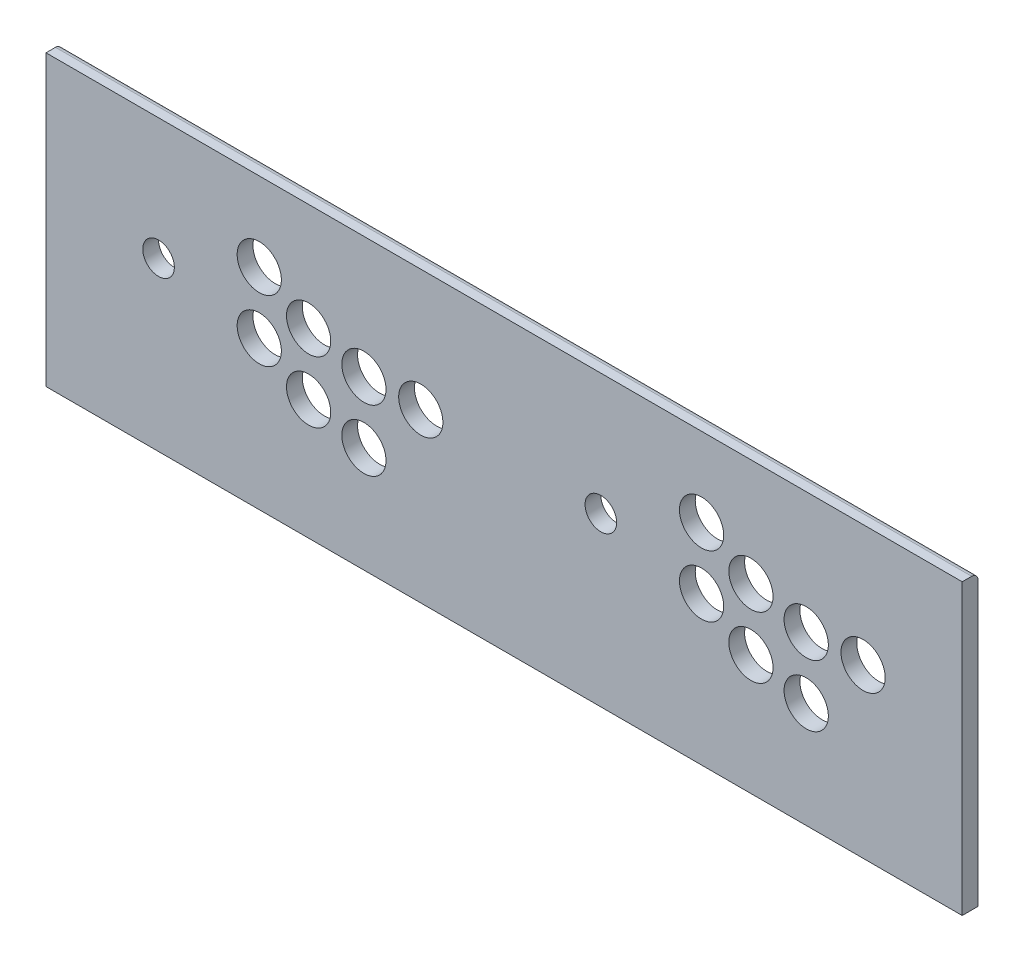
ISO-10303-21;
HEADER;
FILE_DESCRIPTION(('STEP AP214'),'2;1');
FILE_NAME('part.step','',(''),(''),'','','');
FILE_SCHEMA(('AUTOMOTIVE_DESIGN { 1 0 10303 214 1 1 1 1 }'));
ENDSEC;
DATA;
#1=APPLICATION_CONTEXT('core data for automotive mechanical design processes');
#2=APPLICATION_PROTOCOL_DEFINITION('international standard','automotive_design',2000,#1);
#3=PRODUCT_CONTEXT('',#1,'mechanical');
#4=PRODUCT('Part','Part','',(#3));
#5=PRODUCT_RELATED_PRODUCT_CATEGORY('part','',(#4));
#6=PRODUCT_DEFINITION_FORMATION('','',#4);
#7=PRODUCT_DEFINITION_CONTEXT('part definition',#1,'design');
#8=PRODUCT_DEFINITION('design','',#6,#7);
#9=PRODUCT_DEFINITION_SHAPE('','',#8);
#10=(LENGTH_UNIT() NAMED_UNIT(*) SI_UNIT(.MILLI.,.METRE.));
#11=(NAMED_UNIT(*) PLANE_ANGLE_UNIT() SI_UNIT($,.RADIAN.));
#12=(NAMED_UNIT(*) SI_UNIT($,.STERADIAN.) SOLID_ANGLE_UNIT());
#13=UNCERTAINTY_MEASURE_WITH_UNIT(LENGTH_MEASURE(1.E-05),#10,'distance_accuracy_value','');
#14=(GEOMETRIC_REPRESENTATION_CONTEXT(3) GLOBAL_UNCERTAINTY_ASSIGNED_CONTEXT((#13)) GLOBAL_UNIT_ASSIGNED_CONTEXT((#10,
#11,#12)) REPRESENTATION_CONTEXT('',''));
#15=CARTESIAN_POINT('',(0.,0.,0.));
#16=DIRECTION('',(0.,0.,1.));
#17=DIRECTION('',(1.,0.,0.));
#18=AXIS2_PLACEMENT_3D('',#15,#16,#17);
#19=CARTESIAN_POINT('',(0.,0.,10.));
#20=DIRECTION('',(1.,0.,0.));
#21=DIRECTION('',(0.,0.,-1.));
#22=AXIS2_PLACEMENT_3D('',#19,#20,#21);
#23=PLANE('',#22);
#24=DIRECTION('',(0.,0.,-1.));
#25=VECTOR('',#24,1.);
#26=CARTESIAN_POINT('',(0.,183.,10.));
#27=LINE('',#26,#25);
#28=CARTESIAN_POINT('',(0.,183.,10.));
#29=VERTEX_POINT('',#28);
#30=CARTESIAN_POINT('',(0.,183.,4.));
#31=VERTEX_POINT('',#30);
#32=EDGE_CURVE('E110',#29,#31,#27,.T.);
#33=ORIENTED_EDGE('',*,*,#32,.T.);
#34=CARTESIAN_POINT('',(0.,179.,4.));
#35=DIRECTION('',(1.,0.,0.));
#36=DIRECTION('',(0.,0.,-1.));
#37=AXIS2_PLACEMENT_3D('',#34,#35,#36);
#38=CIRCLE('',#37,4.);
#39=CARTESIAN_POINT('',(0.,179.,0.));
#40=VERTEX_POINT('',#39);
#41=EDGE_CURVE('E55',#31,#40,#38,.F.);
#42=ORIENTED_EDGE('',*,*,#41,.T.);
#43=DIRECTION('',(0.,-1.,0.));
#44=VECTOR('',#43,1.);
#45=CARTESIAN_POINT('',(0.,0.,0.));
#46=LINE('',#45,#44);
#47=CARTESIAN_POINT('',(0.,0.,0.));
#48=VERTEX_POINT('',#47);
#49=EDGE_CURVE('E98',#40,#48,#46,.T.);
#50=ORIENTED_EDGE('',*,*,#49,.T.);
#51=DIRECTION('',(0.,0.,-1.));
#52=VECTOR('',#51,1.);
#53=CARTESIAN_POINT('',(0.,0.,10.));
#54=LINE('',#53,#52);
#55=CARTESIAN_POINT('',(0.,0.,10.));
#56=VERTEX_POINT('',#55);
#57=EDGE_CURVE('E83',#56,#48,#54,.T.);
#58=ORIENTED_EDGE('',*,*,#57,.F.);
#59=DIRECTION('',(0.,-1.,0.));
#60=VECTOR('',#59,1.);
#61=CARTESIAN_POINT('',(0.,0.,10.));
#62=LINE('',#61,#60);
#63=EDGE_CURVE('E89',#29,#56,#62,.T.);
#64=ORIENTED_EDGE('',*,*,#63,.F.);
#65=EDGE_LOOP('',(#33,#42,#50,#58,#64));
#66=FACE_BOUND('',#65,.T.);
#67=ADVANCED_FACE('F33',(#66),#23,.F.);
#68=CARTESIAN_POINT('',(0.,0.,10.));
#69=DIRECTION('',(0.,1.,0.));
#70=DIRECTION('',(0.,0.,1.));
#71=AXIS2_PLACEMENT_3D('',#68,#69,#70);
#72=PLANE('',#71);
#73=DIRECTION('',(1.,0.,0.));
#74=VECTOR('',#73,1.);
#75=CARTESIAN_POINT('',(0.,0.,0.));
#76=LINE('',#75,#74);
#77=CARTESIAN_POINT('',(580.,0.,0.));
#78=VERTEX_POINT('',#77);
#79=EDGE_CURVE('E113',#48,#78,#76,.T.);
#80=ORIENTED_EDGE('',*,*,#79,.T.);
#81=DIRECTION('',(0.,0.,-1.));
#82=VECTOR('',#81,1.);
#83=CARTESIAN_POINT('',(580.,0.,10.));
#84=LINE('',#83,#82);
#85=CARTESIAN_POINT('',(580.,0.,10.));
#86=VERTEX_POINT('',#85);
#87=EDGE_CURVE('E85',#86,#78,#84,.T.);
#88=ORIENTED_EDGE('',*,*,#87,.F.);
#89=DIRECTION('',(1.,0.,0.));
#90=VECTOR('',#89,1.);
#91=CARTESIAN_POINT('',(0.,0.,10.));
#92=LINE('',#91,#90);
#93=EDGE_CURVE('E79',#56,#86,#92,.T.);
#94=ORIENTED_EDGE('',*,*,#93,.F.);
#95=ORIENTED_EDGE('',*,*,#57,.T.);
#96=EDGE_LOOP('',(#80,#88,#94,#95));
#97=FACE_BOUND('',#96,.T.);
#98=ADVANCED_FACE('F81',(#97),#72,.F.);
#99=CARTESIAN_POINT('',(580.,0.,10.));
#100=DIRECTION('',(-1.,0.,0.));
#101=DIRECTION('',(0.,0.,1.));
#102=AXIS2_PLACEMENT_3D('',#99,#100,#101);
#103=PLANE('',#102);
#104=DIRECTION('',(0.,1.,0.));
#105=VECTOR('',#104,1.);
#106=CARTESIAN_POINT('',(580.,0.,0.));
#107=LINE('',#106,#105);
#108=CARTESIAN_POINT('',(580.,179.,0.));
#109=VERTEX_POINT('',#108);
#110=EDGE_CURVE('E96',#78,#109,#107,.T.);
#111=ORIENTED_EDGE('',*,*,#110,.T.);
#112=CARTESIAN_POINT('',(580.,179.,4.));
#113=DIRECTION('',(-1.,0.,0.));
#114=DIRECTION('',(0.,0.,1.));
#115=AXIS2_PLACEMENT_3D('',#112,#113,#114);
#116=CIRCLE('',#115,4.);
#117=CARTESIAN_POINT('',(580.,183.,4.));
#118=VERTEX_POINT('',#117);
#119=EDGE_CURVE('E11',#109,#118,#116,.F.);
#120=ORIENTED_EDGE('',*,*,#119,.T.);
#121=DIRECTION('',(0.,0.,-1.));
#122=VECTOR('',#121,1.);
#123=CARTESIAN_POINT('',(580.,183.,10.));
#124=LINE('',#123,#122);
#125=CARTESIAN_POINT('',(580.,183.,10.));
#126=VERTEX_POINT('',#125);
#127=EDGE_CURVE('E104',#126,#118,#124,.T.);
#128=ORIENTED_EDGE('',*,*,#127,.F.);
#129=DIRECTION('',(0.,1.,0.));
#130=VECTOR('',#129,1.);
#131=CARTESIAN_POINT('',(580.,0.,10.));
#132=LINE('',#131,#130);
#133=EDGE_CURVE('E88',#86,#126,#132,.T.);
#134=ORIENTED_EDGE('',*,*,#133,.F.);
#135=ORIENTED_EDGE('',*,*,#87,.T.);
#136=EDGE_LOOP('',(#111,#120,#128,#134,#135));
#137=FACE_BOUND('',#136,.T.);
#138=ADVANCED_FACE('F263',(#137),#103,.F.);
#139=CARTESIAN_POINT('',(0.,183.,10.));
#140=DIRECTION('',(0.,-1.,0.));
#141=DIRECTION('',(0.,0.,-1.));
#142=AXIS2_PLACEMENT_3D('',#139,#140,#141);
#143=PLANE('',#142);
#144=ORIENTED_EDGE('',*,*,#127,.T.);
#145=DIRECTION('',(-1.,0.,0.));
#146=VECTOR('',#145,1.);
#147=CARTESIAN_POINT('',(0.,183.,4.));
#148=LINE('',#147,#146);
#149=EDGE_CURVE('E100',#118,#31,#148,.T.);
#150=ORIENTED_EDGE('',*,*,#149,.T.);
#151=ORIENTED_EDGE('',*,*,#32,.F.);
#152=DIRECTION('',(-1.,0.,0.));
#153=VECTOR('',#152,1.);
#154=CARTESIAN_POINT('',(0.,183.,10.));
#155=LINE('',#154,#153);
#156=EDGE_CURVE('E94',#126,#29,#155,.T.);
#157=ORIENTED_EDGE('',*,*,#156,.F.);
#158=EDGE_LOOP('',(#144,#150,#151,#157));
#159=FACE_BOUND('',#158,.T.);
#160=ADVANCED_FACE('F265',(#159),#143,.F.);
#161=CARTESIAN_POINT('',(0.,0.,10.));
#162=DIRECTION('',(0.,0.,-1.));
#163=DIRECTION('',(-1.,0.,0.));
#164=AXIS2_PLACEMENT_3D('',#161,#162,#163);
#165=PLANE('',#164);
#166=CARTESIAN_POINT('',(415.,133.,10.));
#167=DIRECTION('',(0.,0.,-1.));
#168=DIRECTION('',(-1.,0.,0.));
#169=AXIS2_PLACEMENT_3D('',#166,#167,#168);
#170=CIRCLE('',#169,14.);
#171=CARTESIAN_POINT('',(401.,133.,10.));
#172=VERTEX_POINT('',#171);
#173=EDGE_CURVE('E206',#172,#172,#170,.T.);
#174=ORIENTED_EDGE('',*,*,#173,.T.);
#175=EDGE_LOOP('',(#174));
#176=FACE_BOUND('',#175,.T.);
#177=CARTESIAN_POINT('',(446.25,115.,10.));
#178=DIRECTION('',(0.,0.,-1.));
#179=DIRECTION('',(-1.,0.,0.));
#180=AXIS2_PLACEMENT_3D('',#177,#178,#179);
#181=CIRCLE('',#180,14.);
#182=CARTESIAN_POINT('',(432.25,115.,10.));
#183=VERTEX_POINT('',#182);
#184=EDGE_CURVE('E200',#183,#183,#181,.T.);
#185=ORIENTED_EDGE('',*,*,#184,.T.);
#186=EDGE_LOOP('',(#185));
#187=FACE_BOUND('',#186,.T.);
#188=CARTESIAN_POINT('',(481.25,106.,10.));
#189=DIRECTION('',(0.,0.,-1.));
#190=DIRECTION('',(-1.,0.,0.));
#191=AXIS2_PLACEMENT_3D('',#188,#189,#190);
#192=CIRCLE('',#191,14.);
#193=CARTESIAN_POINT('',(467.25,106.,10.));
#194=VERTEX_POINT('',#193);
#195=EDGE_CURVE('E194',#194,#194,#192,.T.);
#196=ORIENTED_EDGE('',*,*,#195,.T.);
#197=EDGE_LOOP('',(#196));
#198=FACE_BOUND('',#197,.T.);
#199=CARTESIAN_POINT('',(517.25,106.,10.));
#200=DIRECTION('',(0.,0.,-1.));
#201=DIRECTION('',(-1.,0.,0.));
#202=AXIS2_PLACEMENT_3D('',#199,#200,#201);
#203=CIRCLE('',#202,14.);
#204=CARTESIAN_POINT('',(503.25,106.,10.));
#205=VERTEX_POINT('',#204);
#206=EDGE_CURVE('E188',#205,#205,#203,.T.);
#207=ORIENTED_EDGE('',*,*,#206,.T.);
#208=EDGE_LOOP('',(#207));
#209=FACE_BOUND('',#208,.T.);
#210=CARTESIAN_POINT('',(415.,94.0000000000001,10.));
#211=DIRECTION('',(0.,0.,-1.));
#212=DIRECTION('',(-1.,0.,0.));
#213=AXIS2_PLACEMENT_3D('',#210,#211,#212);
#214=CIRCLE('',#213,14.);
#215=CARTESIAN_POINT('',(401.,94.0000000000001,10.));
#216=VERTEX_POINT('',#215);
#217=EDGE_CURVE('E182',#216,#216,#214,.T.);
#218=ORIENTED_EDGE('',*,*,#217,.T.);
#219=EDGE_LOOP('',(#218));
#220=FACE_BOUND('',#219,.T.);
#221=CARTESIAN_POINT('',(446.25,76.0000000000001,10.));
#222=DIRECTION('',(0.,0.,-1.));
#223=DIRECTION('',(-1.,0.,0.));
#224=AXIS2_PLACEMENT_3D('',#221,#222,#223);
#225=CIRCLE('',#224,14.);
#226=CARTESIAN_POINT('',(432.25,76.0000000000001,10.));
#227=VERTEX_POINT('',#226);
#228=EDGE_CURVE('E176',#227,#227,#225,.T.);
#229=ORIENTED_EDGE('',*,*,#228,.T.);
#230=EDGE_LOOP('',(#229));
#231=FACE_BOUND('',#230,.T.);
#232=CARTESIAN_POINT('',(351.25,106.,10.));
#233=DIRECTION('',(0.,0.,-1.));
#234=DIRECTION('',(-1.,0.,0.));
#235=AXIS2_PLACEMENT_3D('',#232,#233,#234);
#236=CIRCLE('',#235,9.99999999999999);
#237=CARTESIAN_POINT('',(341.25,106.,10.));
#238=VERTEX_POINT('',#237);
#239=EDGE_CURVE('E170',#238,#238,#236,.T.);
#240=ORIENTED_EDGE('',*,*,#239,.T.);
#241=EDGE_LOOP('',(#240));
#242=FACE_BOUND('',#241,.T.);
#243=CARTESIAN_POINT('',(481.25,67.0000000000001,10.));
#244=DIRECTION('',(0.,0.,-1.));
#245=DIRECTION('',(-1.,0.,0.));
#246=AXIS2_PLACEMENT_3D('',#243,#244,#245);
#247=CIRCLE('',#246,14.);
#248=CARTESIAN_POINT('',(467.25,67.0000000000001,10.));
#249=VERTEX_POINT('',#248);
#250=EDGE_CURVE('E164',#249,#249,#247,.T.);
#251=ORIENTED_EDGE('',*,*,#250,.T.);
#252=EDGE_LOOP('',(#251));
#253=FACE_BOUND('',#252,.T.);
#254=CARTESIAN_POINT('',(135.,133.,10.));
#255=DIRECTION('',(0.,0.,-1.));
#256=DIRECTION('',(-1.,0.,0.));
#257=AXIS2_PLACEMENT_3D('',#254,#255,#256);
#258=CIRCLE('',#257,14.);
#259=CARTESIAN_POINT('',(121.,133.,10.));
#260=VERTEX_POINT('',#259);
#261=EDGE_CURVE('E158',#260,#260,#258,.T.);
#262=ORIENTED_EDGE('',*,*,#261,.T.);
#263=EDGE_LOOP('',(#262));
#264=FACE_BOUND('',#263,.T.);
#265=CARTESIAN_POINT('',(166.25,115.,10.));
#266=DIRECTION('',(0.,0.,-1.));
#267=DIRECTION('',(-1.,0.,0.));
#268=AXIS2_PLACEMENT_3D('',#265,#266,#267);
#269=CIRCLE('',#268,14.);
#270=CARTESIAN_POINT('',(152.25,115.,10.));
#271=VERTEX_POINT('',#270);
#272=EDGE_CURVE('E152',#271,#271,#269,.T.);
#273=ORIENTED_EDGE('',*,*,#272,.T.);
#274=EDGE_LOOP('',(#273));
#275=FACE_BOUND('',#274,.T.);
#276=CARTESIAN_POINT('',(201.25,106.,10.));
#277=DIRECTION('',(0.,0.,-1.));
#278=DIRECTION('',(-1.,0.,0.));
#279=AXIS2_PLACEMENT_3D('',#276,#277,#278);
#280=CIRCLE('',#279,14.);
#281=CARTESIAN_POINT('',(187.25,106.,10.));
#282=VERTEX_POINT('',#281);
#283=EDGE_CURVE('E146',#282,#282,#280,.T.);
#284=ORIENTED_EDGE('',*,*,#283,.T.);
#285=EDGE_LOOP('',(#284));
#286=FACE_BOUND('',#285,.T.);
#287=CARTESIAN_POINT('',(237.25,106.,10.));
#288=DIRECTION('',(0.,0.,-1.));
#289=DIRECTION('',(-1.,0.,0.));
#290=AXIS2_PLACEMENT_3D('',#287,#288,#289);
#291=CIRCLE('',#290,14.);
#292=CARTESIAN_POINT('',(223.25,106.,10.));
#293=VERTEX_POINT('',#292);
#294=EDGE_CURVE('E140',#293,#293,#291,.T.);
#295=ORIENTED_EDGE('',*,*,#294,.T.);
#296=EDGE_LOOP('',(#295));
#297=FACE_BOUND('',#296,.T.);
#298=CARTESIAN_POINT('',(135.,94.0000000000001,10.));
#299=DIRECTION('',(0.,0.,-1.));
#300=DIRECTION('',(-1.,0.,0.));
#301=AXIS2_PLACEMENT_3D('',#298,#299,#300);
#302=CIRCLE('',#301,14.);
#303=CARTESIAN_POINT('',(121.,94.0000000000001,10.));
#304=VERTEX_POINT('',#303);
#305=EDGE_CURVE('E134',#304,#304,#302,.T.);
#306=ORIENTED_EDGE('',*,*,#305,.T.);
#307=EDGE_LOOP('',(#306));
#308=FACE_BOUND('',#307,.T.);
#309=CARTESIAN_POINT('',(166.25,76.0000000000001,10.));
#310=DIRECTION('',(0.,0.,-1.));
#311=DIRECTION('',(-1.,0.,0.));
#312=AXIS2_PLACEMENT_3D('',#309,#310,#311);
#313=CIRCLE('',#312,14.);
#314=CARTESIAN_POINT('',(152.25,76.0000000000001,10.));
#315=VERTEX_POINT('',#314);
#316=EDGE_CURVE('E128',#315,#315,#313,.T.);
#317=ORIENTED_EDGE('',*,*,#316,.T.);
#318=EDGE_LOOP('',(#317));
#319=FACE_BOUND('',#318,.T.);
#320=CARTESIAN_POINT('',(71.25,106.,10.));
#321=DIRECTION('',(0.,0.,-1.));
#322=DIRECTION('',(-1.,0.,0.));
#323=AXIS2_PLACEMENT_3D('',#320,#321,#322);
#324=CIRCLE('',#323,9.99999999999999);
#325=CARTESIAN_POINT('',(61.25,106.,10.));
#326=VERTEX_POINT('',#325);
#327=EDGE_CURVE('E122',#326,#326,#324,.T.);
#328=ORIENTED_EDGE('',*,*,#327,.T.);
#329=EDGE_LOOP('',(#328));
#330=FACE_BOUND('',#329,.T.);
#331=CARTESIAN_POINT('',(201.25,67.0000000000001,10.));
#332=DIRECTION('',(0.,0.,-1.));
#333=DIRECTION('',(-1.,0.,0.));
#334=AXIS2_PLACEMENT_3D('',#331,#332,#333);
#335=CIRCLE('',#334,14.);
#336=CARTESIAN_POINT('',(187.25,67.0000000000001,10.));
#337=VERTEX_POINT('',#336);
#338=EDGE_CURVE('E116',#337,#337,#335,.T.);
#339=ORIENTED_EDGE('',*,*,#338,.T.);
#340=EDGE_LOOP('',(#339));
#341=FACE_BOUND('',#340,.T.);
#342=ORIENTED_EDGE('',*,*,#63,.T.);
#343=ORIENTED_EDGE('',*,*,#93,.T.);
#344=ORIENTED_EDGE('',*,*,#133,.T.);
#345=ORIENTED_EDGE('',*,*,#156,.T.);
#346=EDGE_LOOP('',(#342,#343,#344,#345));
#347=FACE_BOUND('',#346,.T.);
#348=ADVANCED_FACE('F92',(#176,#187,#198,#209,#220,#231,#242,#253,#264,#275,#286,#297,#308,#319,
#330,#341,#347),#165,.F.);
#349=CARTESIAN_POINT('',(0.,0.,0.));
#350=DIRECTION('',(0.,0.,-1.));
#351=DIRECTION('',(-1.,0.,0.));
#352=AXIS2_PLACEMENT_3D('',#349,#350,#351);
#353=PLANE('',#352);
#354=CARTESIAN_POINT('',(415.,133.,0.));
#355=DIRECTION('',(0.,0.,-1.));
#356=DIRECTION('',(-1.,0.,0.));
#357=AXIS2_PLACEMENT_3D('',#354,#355,#356);
#358=CIRCLE('',#357,14.);
#359=CARTESIAN_POINT('',(401.,133.,0.));
#360=VERTEX_POINT('',#359);
#361=EDGE_CURVE('E209',#360,#360,#358,.T.);
#362=ORIENTED_EDGE('',*,*,#361,.F.);
#363=EDGE_LOOP('',(#362));
#364=FACE_BOUND('',#363,.T.);
#365=CARTESIAN_POINT('',(446.25,115.,0.));
#366=DIRECTION('',(0.,0.,-1.));
#367=DIRECTION('',(-1.,0.,0.));
#368=AXIS2_PLACEMENT_3D('',#365,#366,#367);
#369=CIRCLE('',#368,14.);
#370=CARTESIAN_POINT('',(432.25,115.,0.));
#371=VERTEX_POINT('',#370);
#372=EDGE_CURVE('E203',#371,#371,#369,.T.);
#373=ORIENTED_EDGE('',*,*,#372,.F.);
#374=EDGE_LOOP('',(#373));
#375=FACE_BOUND('',#374,.T.);
#376=CARTESIAN_POINT('',(481.25,106.,0.));
#377=DIRECTION('',(0.,0.,-1.));
#378=DIRECTION('',(-1.,0.,0.));
#379=AXIS2_PLACEMENT_3D('',#376,#377,#378);
#380=CIRCLE('',#379,14.);
#381=CARTESIAN_POINT('',(467.25,106.,0.));
#382=VERTEX_POINT('',#381);
#383=EDGE_CURVE('E197',#382,#382,#380,.T.);
#384=ORIENTED_EDGE('',*,*,#383,.F.);
#385=EDGE_LOOP('',(#384));
#386=FACE_BOUND('',#385,.T.);
#387=CARTESIAN_POINT('',(517.25,106.,0.));
#388=DIRECTION('',(0.,0.,-1.));
#389=DIRECTION('',(-1.,0.,0.));
#390=AXIS2_PLACEMENT_3D('',#387,#388,#389);
#391=CIRCLE('',#390,14.);
#392=CARTESIAN_POINT('',(503.25,106.,0.));
#393=VERTEX_POINT('',#392);
#394=EDGE_CURVE('E191',#393,#393,#391,.T.);
#395=ORIENTED_EDGE('',*,*,#394,.F.);
#396=EDGE_LOOP('',(#395));
#397=FACE_BOUND('',#396,.T.);
#398=CARTESIAN_POINT('',(415.,94.0000000000001,0.));
#399=DIRECTION('',(0.,0.,-1.));
#400=DIRECTION('',(-1.,0.,0.));
#401=AXIS2_PLACEMENT_3D('',#398,#399,#400);
#402=CIRCLE('',#401,14.);
#403=CARTESIAN_POINT('',(401.,94.0000000000001,0.));
#404=VERTEX_POINT('',#403);
#405=EDGE_CURVE('E185',#404,#404,#402,.T.);
#406=ORIENTED_EDGE('',*,*,#405,.F.);
#407=EDGE_LOOP('',(#406));
#408=FACE_BOUND('',#407,.T.);
#409=CARTESIAN_POINT('',(446.25,76.0000000000001,0.));
#410=DIRECTION('',(0.,0.,-1.));
#411=DIRECTION('',(-1.,0.,0.));
#412=AXIS2_PLACEMENT_3D('',#409,#410,#411);
#413=CIRCLE('',#412,14.);
#414=CARTESIAN_POINT('',(432.25,76.0000000000001,0.));
#415=VERTEX_POINT('',#414);
#416=EDGE_CURVE('E179',#415,#415,#413,.T.);
#417=ORIENTED_EDGE('',*,*,#416,.F.);
#418=EDGE_LOOP('',(#417));
#419=FACE_BOUND('',#418,.T.);
#420=CARTESIAN_POINT('',(351.25,106.,0.));
#421=DIRECTION('',(0.,0.,-1.));
#422=DIRECTION('',(-1.,0.,0.));
#423=AXIS2_PLACEMENT_3D('',#420,#421,#422);
#424=CIRCLE('',#423,9.99999999999999);
#425=CARTESIAN_POINT('',(341.25,106.,0.));
#426=VERTEX_POINT('',#425);
#427=EDGE_CURVE('E173',#426,#426,#424,.T.);
#428=ORIENTED_EDGE('',*,*,#427,.F.);
#429=EDGE_LOOP('',(#428));
#430=FACE_BOUND('',#429,.T.);
#431=CARTESIAN_POINT('',(481.25,67.0000000000001,0.));
#432=DIRECTION('',(0.,0.,-1.));
#433=DIRECTION('',(-1.,0.,0.));
#434=AXIS2_PLACEMENT_3D('',#431,#432,#433);
#435=CIRCLE('',#434,14.);
#436=CARTESIAN_POINT('',(467.25,67.0000000000001,0.));
#437=VERTEX_POINT('',#436);
#438=EDGE_CURVE('E167',#437,#437,#435,.T.);
#439=ORIENTED_EDGE('',*,*,#438,.F.);
#440=EDGE_LOOP('',(#439));
#441=FACE_BOUND('',#440,.T.);
#442=CARTESIAN_POINT('',(135.,133.,0.));
#443=DIRECTION('',(0.,0.,-1.));
#444=DIRECTION('',(-1.,0.,0.));
#445=AXIS2_PLACEMENT_3D('',#442,#443,#444);
#446=CIRCLE('',#445,14.);
#447=CARTESIAN_POINT('',(121.,133.,0.));
#448=VERTEX_POINT('',#447);
#449=EDGE_CURVE('E161',#448,#448,#446,.T.);
#450=ORIENTED_EDGE('',*,*,#449,.F.);
#451=EDGE_LOOP('',(#450));
#452=FACE_BOUND('',#451,.T.);
#453=CARTESIAN_POINT('',(166.25,115.,0.));
#454=DIRECTION('',(0.,0.,-1.));
#455=DIRECTION('',(-1.,0.,0.));
#456=AXIS2_PLACEMENT_3D('',#453,#454,#455);
#457=CIRCLE('',#456,14.);
#458=CARTESIAN_POINT('',(152.25,115.,0.));
#459=VERTEX_POINT('',#458);
#460=EDGE_CURVE('E155',#459,#459,#457,.T.);
#461=ORIENTED_EDGE('',*,*,#460,.F.);
#462=EDGE_LOOP('',(#461));
#463=FACE_BOUND('',#462,.T.);
#464=CARTESIAN_POINT('',(201.25,106.,0.));
#465=DIRECTION('',(0.,0.,-1.));
#466=DIRECTION('',(-1.,0.,0.));
#467=AXIS2_PLACEMENT_3D('',#464,#465,#466);
#468=CIRCLE('',#467,14.);
#469=CARTESIAN_POINT('',(187.25,106.,0.));
#470=VERTEX_POINT('',#469);
#471=EDGE_CURVE('E149',#470,#470,#468,.T.);
#472=ORIENTED_EDGE('',*,*,#471,.F.);
#473=EDGE_LOOP('',(#472));
#474=FACE_BOUND('',#473,.T.);
#475=CARTESIAN_POINT('',(237.25,106.,0.));
#476=DIRECTION('',(0.,0.,-1.));
#477=DIRECTION('',(-1.,0.,0.));
#478=AXIS2_PLACEMENT_3D('',#475,#476,#477);
#479=CIRCLE('',#478,14.);
#480=CARTESIAN_POINT('',(223.25,106.,0.));
#481=VERTEX_POINT('',#480);
#482=EDGE_CURVE('E143',#481,#481,#479,.T.);
#483=ORIENTED_EDGE('',*,*,#482,.F.);
#484=EDGE_LOOP('',(#483));
#485=FACE_BOUND('',#484,.T.);
#486=CARTESIAN_POINT('',(135.,94.0000000000001,0.));
#487=DIRECTION('',(0.,0.,-1.));
#488=DIRECTION('',(-1.,0.,0.));
#489=AXIS2_PLACEMENT_3D('',#486,#487,#488);
#490=CIRCLE('',#489,14.);
#491=CARTESIAN_POINT('',(121.,94.0000000000001,0.));
#492=VERTEX_POINT('',#491);
#493=EDGE_CURVE('E137',#492,#492,#490,.T.);
#494=ORIENTED_EDGE('',*,*,#493,.F.);
#495=EDGE_LOOP('',(#494));
#496=FACE_BOUND('',#495,.T.);
#497=CARTESIAN_POINT('',(166.25,76.0000000000001,0.));
#498=DIRECTION('',(0.,0.,-1.));
#499=DIRECTION('',(-1.,0.,0.));
#500=AXIS2_PLACEMENT_3D('',#497,#498,#499);
#501=CIRCLE('',#500,14.);
#502=CARTESIAN_POINT('',(152.25,76.0000000000001,0.));
#503=VERTEX_POINT('',#502);
#504=EDGE_CURVE('E131',#503,#503,#501,.T.);
#505=ORIENTED_EDGE('',*,*,#504,.F.);
#506=EDGE_LOOP('',(#505));
#507=FACE_BOUND('',#506,.T.);
#508=CARTESIAN_POINT('',(71.25,106.,0.));
#509=DIRECTION('',(0.,0.,-1.));
#510=DIRECTION('',(-1.,0.,0.));
#511=AXIS2_PLACEMENT_3D('',#508,#509,#510);
#512=CIRCLE('',#511,9.99999999999999);
#513=CARTESIAN_POINT('',(61.25,106.,0.));
#514=VERTEX_POINT('',#513);
#515=EDGE_CURVE('E125',#514,#514,#512,.T.);
#516=ORIENTED_EDGE('',*,*,#515,.F.);
#517=EDGE_LOOP('',(#516));
#518=FACE_BOUND('',#517,.T.);
#519=CARTESIAN_POINT('',(201.25,67.0000000000001,0.));
#520=DIRECTION('',(0.,0.,-1.));
#521=DIRECTION('',(-1.,0.,0.));
#522=AXIS2_PLACEMENT_3D('',#519,#520,#521);
#523=CIRCLE('',#522,14.);
#524=CARTESIAN_POINT('',(187.25,67.0000000000001,0.));
#525=VERTEX_POINT('',#524);
#526=EDGE_CURVE('E119',#525,#525,#523,.T.);
#527=ORIENTED_EDGE('',*,*,#526,.F.);
#528=EDGE_LOOP('',(#527));
#529=FACE_BOUND('',#528,.T.);
#530=ORIENTED_EDGE('',*,*,#49,.F.);
#531=DIRECTION('',(-1.,0.,0.));
#532=VECTOR('',#531,1.);
#533=CARTESIAN_POINT('',(580.,179.,0.));
#534=LINE('',#533,#532);
#535=EDGE_CURVE('E41',#40,#109,#534,.F.);
#536=ORIENTED_EDGE('',*,*,#535,.T.);
#537=ORIENTED_EDGE('',*,*,#110,.F.);
#538=ORIENTED_EDGE('',*,*,#79,.F.);
#539=EDGE_LOOP('',(#530,#536,#537,#538));
#540=FACE_BOUND('',#539,.T.);
#541=ADVANCED_FACE('F224',(#364,#375,#386,#397,#408,#419,#430,#441,#452,#463,#474,#485,#496,
#507,#518,#529,#540),#353,.T.);
#542=CARTESIAN_POINT('',(201.25,67.0000000000001,10.));
#543=DIRECTION('',(0.,0.,-1.));
#544=DIRECTION('',(-1.,0.,0.));
#545=AXIS2_PLACEMENT_3D('',#542,#543,#544);
#546=CYLINDRICAL_SURFACE('',#545,14.);
#547=ORIENTED_EDGE('',*,*,#338,.F.);
#548=EDGE_LOOP('',(#547));
#549=FACE_BOUND('',#548,.T.);
#550=ORIENTED_EDGE('',*,*,#526,.T.);
#551=EDGE_LOOP('',(#550));
#552=FACE_BOUND('',#551,.T.);
#553=ADVANCED_FACE('F227',(#549,#552),#546,.F.);
#554=CARTESIAN_POINT('',(71.25,106.,10.));
#555=DIRECTION('',(0.,0.,-1.));
#556=DIRECTION('',(-1.,0.,0.));
#557=AXIS2_PLACEMENT_3D('',#554,#555,#556);
#558=CYLINDRICAL_SURFACE('',#557,9.99999999999999);
#559=ORIENTED_EDGE('',*,*,#327,.F.);
#560=EDGE_LOOP('',(#559));
#561=FACE_BOUND('',#560,.T.);
#562=ORIENTED_EDGE('',*,*,#515,.T.);
#563=EDGE_LOOP('',(#562));
#564=FACE_BOUND('',#563,.T.);
#565=ADVANCED_FACE('F314',(#561,#564),#558,.F.);
#566=CARTESIAN_POINT('',(166.25,76.0000000000001,10.));
#567=DIRECTION('',(0.,0.,-1.));
#568=DIRECTION('',(-1.,0.,0.));
#569=AXIS2_PLACEMENT_3D('',#566,#567,#568);
#570=CYLINDRICAL_SURFACE('',#569,14.);
#571=ORIENTED_EDGE('',*,*,#316,.F.);
#572=EDGE_LOOP('',(#571));
#573=FACE_BOUND('',#572,.T.);
#574=ORIENTED_EDGE('',*,*,#504,.T.);
#575=EDGE_LOOP('',(#574));
#576=FACE_BOUND('',#575,.T.);
#577=ADVANCED_FACE('F321',(#573,#576),#570,.F.);
#578=CARTESIAN_POINT('',(135.,94.0000000000001,10.));
#579=DIRECTION('',(0.,0.,-1.));
#580=DIRECTION('',(-1.,0.,0.));
#581=AXIS2_PLACEMENT_3D('',#578,#579,#580);
#582=CYLINDRICAL_SURFACE('',#581,14.);
#583=ORIENTED_EDGE('',*,*,#305,.F.);
#584=EDGE_LOOP('',(#583));
#585=FACE_BOUND('',#584,.T.);
#586=ORIENTED_EDGE('',*,*,#493,.T.);
#587=EDGE_LOOP('',(#586));
#588=FACE_BOUND('',#587,.T.);
#589=ADVANCED_FACE('F329',(#585,#588),#582,.F.);
#590=CARTESIAN_POINT('',(237.25,106.,10.));
#591=DIRECTION('',(0.,0.,-1.));
#592=DIRECTION('',(-1.,0.,0.));
#593=AXIS2_PLACEMENT_3D('',#590,#591,#592);
#594=CYLINDRICAL_SURFACE('',#593,14.);
#595=ORIENTED_EDGE('',*,*,#294,.F.);
#596=EDGE_LOOP('',(#595));
#597=FACE_BOUND('',#596,.T.);
#598=ORIENTED_EDGE('',*,*,#482,.T.);
#599=EDGE_LOOP('',(#598));
#600=FACE_BOUND('',#599,.T.);
#601=ADVANCED_FACE('F337',(#597,#600),#594,.F.);
#602=CARTESIAN_POINT('',(201.25,106.,10.));
#603=DIRECTION('',(0.,0.,-1.));
#604=DIRECTION('',(-1.,0.,0.));
#605=AXIS2_PLACEMENT_3D('',#602,#603,#604);
#606=CYLINDRICAL_SURFACE('',#605,14.);
#607=ORIENTED_EDGE('',*,*,#283,.F.);
#608=EDGE_LOOP('',(#607));
#609=FACE_BOUND('',#608,.T.);
#610=ORIENTED_EDGE('',*,*,#471,.T.);
#611=EDGE_LOOP('',(#610));
#612=FACE_BOUND('',#611,.T.);
#613=ADVANCED_FACE('F345',(#609,#612),#606,.F.);
#614=CARTESIAN_POINT('',(166.25,115.,10.));
#615=DIRECTION('',(0.,0.,-1.));
#616=DIRECTION('',(-1.,0.,0.));
#617=AXIS2_PLACEMENT_3D('',#614,#615,#616);
#618=CYLINDRICAL_SURFACE('',#617,14.);
#619=ORIENTED_EDGE('',*,*,#272,.F.);
#620=EDGE_LOOP('',(#619));
#621=FACE_BOUND('',#620,.T.);
#622=ORIENTED_EDGE('',*,*,#460,.T.);
#623=EDGE_LOOP('',(#622));
#624=FACE_BOUND('',#623,.T.);
#625=ADVANCED_FACE('F353',(#621,#624),#618,.F.);
#626=CARTESIAN_POINT('',(135.,133.,10.));
#627=DIRECTION('',(0.,0.,-1.));
#628=DIRECTION('',(-1.,0.,0.));
#629=AXIS2_PLACEMENT_3D('',#626,#627,#628);
#630=CYLINDRICAL_SURFACE('',#629,14.);
#631=ORIENTED_EDGE('',*,*,#261,.F.);
#632=EDGE_LOOP('',(#631));
#633=FACE_BOUND('',#632,.T.);
#634=ORIENTED_EDGE('',*,*,#449,.T.);
#635=EDGE_LOOP('',(#634));
#636=FACE_BOUND('',#635,.T.);
#637=ADVANCED_FACE('F361',(#633,#636),#630,.F.);
#638=CARTESIAN_POINT('',(481.25,67.0000000000001,10.));
#639=DIRECTION('',(0.,0.,-1.));
#640=DIRECTION('',(-1.,0.,0.));
#641=AXIS2_PLACEMENT_3D('',#638,#639,#640);
#642=CYLINDRICAL_SURFACE('',#641,14.);
#643=ORIENTED_EDGE('',*,*,#250,.F.);
#644=EDGE_LOOP('',(#643));
#645=FACE_BOUND('',#644,.T.);
#646=ORIENTED_EDGE('',*,*,#438,.T.);
#647=EDGE_LOOP('',(#646));
#648=FACE_BOUND('',#647,.T.);
#649=ADVANCED_FACE('F368',(#645,#648),#642,.F.);
#650=CARTESIAN_POINT('',(351.25,106.,10.));
#651=DIRECTION('',(0.,0.,-1.));
#652=DIRECTION('',(-1.,0.,0.));
#653=AXIS2_PLACEMENT_3D('',#650,#651,#652);
#654=CYLINDRICAL_SURFACE('',#653,9.99999999999999);
#655=ORIENTED_EDGE('',*,*,#239,.F.);
#656=EDGE_LOOP('',(#655));
#657=FACE_BOUND('',#656,.T.);
#658=ORIENTED_EDGE('',*,*,#427,.T.);
#659=EDGE_LOOP('',(#658));
#660=FACE_BOUND('',#659,.T.);
#661=ADVANCED_FACE('F375',(#657,#660),#654,.F.);
#662=CARTESIAN_POINT('',(446.25,76.0000000000001,10.));
#663=DIRECTION('',(0.,0.,-1.));
#664=DIRECTION('',(-1.,0.,0.));
#665=AXIS2_PLACEMENT_3D('',#662,#663,#664);
#666=CYLINDRICAL_SURFACE('',#665,14.);
#667=ORIENTED_EDGE('',*,*,#228,.F.);
#668=EDGE_LOOP('',(#667));
#669=FACE_BOUND('',#668,.T.);
#670=ORIENTED_EDGE('',*,*,#416,.T.);
#671=EDGE_LOOP('',(#670));
#672=FACE_BOUND('',#671,.T.);
#673=ADVANCED_FACE('F383',(#669,#672),#666,.F.);
#674=CARTESIAN_POINT('',(415.,94.0000000000001,10.));
#675=DIRECTION('',(0.,0.,-1.));
#676=DIRECTION('',(-1.,0.,0.));
#677=AXIS2_PLACEMENT_3D('',#674,#675,#676);
#678=CYLINDRICAL_SURFACE('',#677,14.);
#679=ORIENTED_EDGE('',*,*,#217,.F.);
#680=EDGE_LOOP('',(#679));
#681=FACE_BOUND('',#680,.T.);
#682=ORIENTED_EDGE('',*,*,#405,.T.);
#683=EDGE_LOOP('',(#682));
#684=FACE_BOUND('',#683,.T.);
#685=ADVANCED_FACE('F391',(#681,#684),#678,.F.);
#686=CARTESIAN_POINT('',(517.25,106.,10.));
#687=DIRECTION('',(0.,0.,-1.));
#688=DIRECTION('',(-1.,0.,0.));
#689=AXIS2_PLACEMENT_3D('',#686,#687,#688);
#690=CYLINDRICAL_SURFACE('',#689,14.);
#691=ORIENTED_EDGE('',*,*,#206,.F.);
#692=EDGE_LOOP('',(#691));
#693=FACE_BOUND('',#692,.T.);
#694=ORIENTED_EDGE('',*,*,#394,.T.);
#695=EDGE_LOOP('',(#694));
#696=FACE_BOUND('',#695,.T.);
#697=ADVANCED_FACE('F399',(#693,#696),#690,.F.);
#698=CARTESIAN_POINT('',(481.25,106.,10.));
#699=DIRECTION('',(0.,0.,-1.));
#700=DIRECTION('',(-1.,0.,0.));
#701=AXIS2_PLACEMENT_3D('',#698,#699,#700);
#702=CYLINDRICAL_SURFACE('',#701,14.);
#703=ORIENTED_EDGE('',*,*,#195,.F.);
#704=EDGE_LOOP('',(#703));
#705=FACE_BOUND('',#704,.T.);
#706=ORIENTED_EDGE('',*,*,#383,.T.);
#707=EDGE_LOOP('',(#706));
#708=FACE_BOUND('',#707,.T.);
#709=ADVANCED_FACE('F407',(#705,#708),#702,.F.);
#710=CARTESIAN_POINT('',(446.25,115.,10.));
#711=DIRECTION('',(0.,0.,-1.));
#712=DIRECTION('',(-1.,0.,0.));
#713=AXIS2_PLACEMENT_3D('',#710,#711,#712);
#714=CYLINDRICAL_SURFACE('',#713,14.);
#715=ORIENTED_EDGE('',*,*,#184,.F.);
#716=EDGE_LOOP('',(#715));
#717=FACE_BOUND('',#716,.T.);
#718=ORIENTED_EDGE('',*,*,#372,.T.);
#719=EDGE_LOOP('',(#718));
#720=FACE_BOUND('',#719,.T.);
#721=ADVANCED_FACE('F220',(#717,#720),#714,.F.);
#722=CARTESIAN_POINT('',(415.,133.,10.));
#723=DIRECTION('',(0.,0.,-1.));
#724=DIRECTION('',(-1.,0.,0.));
#725=AXIS2_PLACEMENT_3D('',#722,#723,#724);
#726=CYLINDRICAL_SURFACE('',#725,14.);
#727=ORIENTED_EDGE('',*,*,#173,.F.);
#728=EDGE_LOOP('',(#727));
#729=FACE_BOUND('',#728,.T.);
#730=ORIENTED_EDGE('',*,*,#361,.T.);
#731=EDGE_LOOP('',(#730));
#732=FACE_BOUND('',#731,.T.);
#733=ADVANCED_FACE('F217',(#729,#732),#726,.F.);
#734=CARTESIAN_POINT('',(0.,179.,4.));
#735=DIRECTION('',(1.,0.,0.));
#736=DIRECTION('',(0.,0.,-1.));
#737=AXIS2_PLACEMENT_3D('',#734,#735,#736);
#738=CYLINDRICAL_SURFACE('',#737,4.);
#739=ORIENTED_EDGE('',*,*,#119,.F.);
#740=ORIENTED_EDGE('',*,*,#535,.F.);
#741=ORIENTED_EDGE('',*,*,#41,.F.);
#742=ORIENTED_EDGE('',*,*,#149,.F.);
#743=EDGE_LOOP('',(#739,#740,#741,#742));
#744=FACE_BOUND('',#743,.T.);
#745=ADVANCED_FACE('F35',(#744),#738,.T.);
#746=CLOSED_SHELL('',(#67,#98,#138,#160,#348,#541,#553,#565,#577,#589,#601,#613,#625,#637,#649,
#661,#673,#685,#697,#709,#721,#733,#745));
#747=MANIFOLD_SOLID_BREP('B2',#746);
#748=ADVANCED_BREP_SHAPE_REPRESENTATION('',(#18,#747),#14);
#749=SHAPE_DEFINITION_REPRESENTATION(#9,#748);
ENDSEC;
END-ISO-10303-21;
